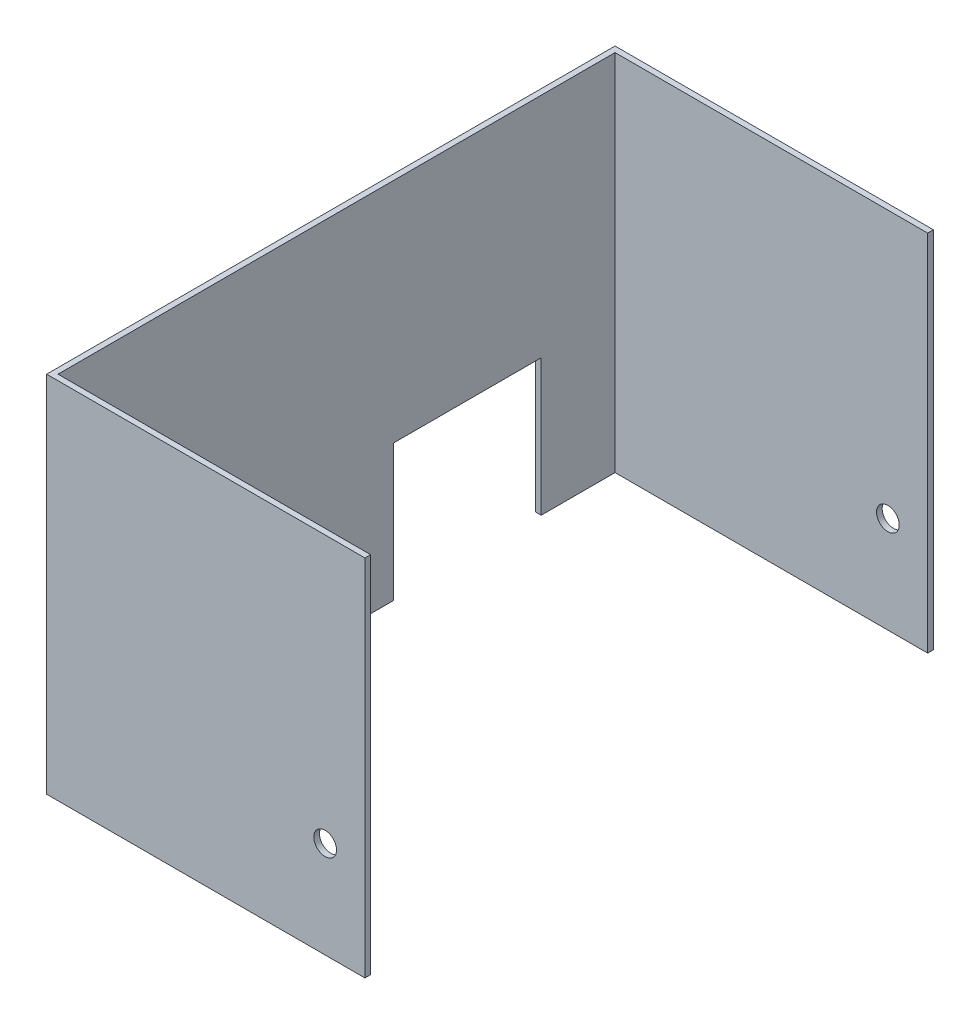
ISO-10303-21;
HEADER;
FILE_DESCRIPTION(('STEP AP214'),'2;1');
FILE_NAME('part.step','',(''),(''),'','','');
FILE_SCHEMA(('AUTOMOTIVE_DESIGN { 1 0 10303 214 1 1 1 1 }'));
ENDSEC;
DATA;
#1=APPLICATION_CONTEXT('core data for automotive mechanical design processes');
#2=APPLICATION_PROTOCOL_DEFINITION('international standard','automotive_design',2000,#1);
#3=PRODUCT_CONTEXT('',#1,'mechanical');
#4=PRODUCT('Part','Part','',(#3));
#5=PRODUCT_RELATED_PRODUCT_CATEGORY('part','',(#4));
#6=PRODUCT_DEFINITION_FORMATION('','',#4);
#7=PRODUCT_DEFINITION_CONTEXT('part definition',#1,'design');
#8=PRODUCT_DEFINITION('design','',#6,#7);
#9=PRODUCT_DEFINITION_SHAPE('','',#8);
#10=(LENGTH_UNIT() NAMED_UNIT(*) SI_UNIT(.MILLI.,.METRE.));
#11=(NAMED_UNIT(*) PLANE_ANGLE_UNIT() SI_UNIT($,.RADIAN.));
#12=(NAMED_UNIT(*) SI_UNIT($,.STERADIAN.) SOLID_ANGLE_UNIT());
#13=UNCERTAINTY_MEASURE_WITH_UNIT(LENGTH_MEASURE(1.E-05),#10,'distance_accuracy_value','');
#14=(GEOMETRIC_REPRESENTATION_CONTEXT(3) GLOBAL_UNCERTAINTY_ASSIGNED_CONTEXT((#13)) GLOBAL_UNIT_ASSIGNED_CONTEXT((#10,
#11,#12)) REPRESENTATION_CONTEXT('',''));
#15=CARTESIAN_POINT('',(0.,0.,0.));
#16=DIRECTION('',(0.,0.,1.));
#17=DIRECTION('',(1.,0.,0.));
#18=AXIS2_PLACEMENT_3D('',#15,#16,#17);
#19=CARTESIAN_POINT('',(0.,0.,0.));
#20=DIRECTION('',(0.,-1.,0.));
#21=DIRECTION('',(0.,0.,-1.));
#22=AXIS2_PLACEMENT_3D('',#19,#20,#21);
#23=PLANE('',#22);
#24=DIRECTION('',(1.,0.,0.));
#25=VECTOR('',#24,1.);
#26=CARTESIAN_POINT('',(0.,0.,-546.1));
#27=LINE('',#26,#25);
#28=CARTESIAN_POINT('',(0.,0.,-546.1));
#29=VERTEX_POINT('',#28);
#30=CARTESIAN_POINT('',(6.35,0.,-546.1));
#31=VERTEX_POINT('',#30);
#32=EDGE_CURVE('E174',#29,#31,#27,.T.);
#33=ORIENTED_EDGE('',*,*,#32,.F.);
#34=DIRECTION('',(0.,0.,1.));
#35=VECTOR('',#34,1.);
#36=CARTESIAN_POINT('',(0.,0.,0.));
#37=LINE('',#36,#35);
#38=CARTESIAN_POINT('',(0.,0.,-635.));
#39=VERTEX_POINT('',#38);
#40=EDGE_CURVE('E157',#39,#29,#37,.T.);
#41=ORIENTED_EDGE('',*,*,#40,.F.);
#42=DIRECTION('',(-1.,0.,0.));
#43=VECTOR('',#42,1.);
#44=CARTESIAN_POINT('',(0.,0.,-635.));
#45=LINE('',#44,#43);
#46=CARTESIAN_POINT('',(355.6,0.,-635.));
#47=VERTEX_POINT('',#46);
#48=EDGE_CURVE('E223',#47,#39,#45,.T.);
#49=ORIENTED_EDGE('',*,*,#48,.F.);
#50=DIRECTION('',(0.,0.,-1.));
#51=VECTOR('',#50,1.);
#52=CARTESIAN_POINT('',(355.6,0.,0.));
#53=LINE('',#52,#51);
#54=CARTESIAN_POINT('',(355.6,0.,-628.65));
#55=VERTEX_POINT('',#54);
#56=EDGE_CURVE('E240',#55,#47,#53,.T.);
#57=ORIENTED_EDGE('',*,*,#56,.F.);
#58=DIRECTION('',(-1.,0.,0.));
#59=VECTOR('',#58,1.);
#60=CARTESIAN_POINT('',(0.,0.,-628.65));
#61=LINE('',#60,#59);
#62=CARTESIAN_POINT('',(6.35,0.,-628.65));
#63=VERTEX_POINT('',#62);
#64=EDGE_CURVE('E199',#55,#63,#61,.T.);
#65=ORIENTED_EDGE('',*,*,#64,.T.);
#66=DIRECTION('',(0.,0.,1.));
#67=VECTOR('',#66,1.);
#68=CARTESIAN_POINT('',(6.35,0.,0.));
#69=LINE('',#68,#67);
#70=EDGE_CURVE('E194',#63,#31,#69,.T.);
#71=ORIENTED_EDGE('',*,*,#70,.T.);
#72=EDGE_LOOP('',(#33,#41,#49,#57,#65,#71));
#73=FACE_BOUND('',#72,.T.);
#74=ADVANCED_FACE('F44',(#73),#23,.T.);
#75=CARTESIAN_POINT('',(355.6,406.4,0.));
#76=DIRECTION('',(-1.,0.,0.));
#77=DIRECTION('',(0.,0.,1.));
#78=AXIS2_PLACEMENT_3D('',#75,#76,#77);
#79=PLANE('',#78);
#80=DIRECTION('',(0.,-1.,0.));
#81=VECTOR('',#80,1.);
#82=CARTESIAN_POINT('',(355.6,406.4,-6.35));
#83=LINE('',#82,#81);
#84=CARTESIAN_POINT('',(355.6,406.4,-6.35));
#85=VERTEX_POINT('',#84);
#86=CARTESIAN_POINT('',(355.6,0.,-6.35));
#87=VERTEX_POINT('',#86);
#88=EDGE_CURVE('E69',#85,#87,#83,.T.);
#89=ORIENTED_EDGE('',*,*,#88,.F.);
#90=DIRECTION('',(0.,0.,-1.));
#91=VECTOR('',#90,1.);
#92=CARTESIAN_POINT('',(355.6,406.4,0.));
#93=LINE('',#92,#91);
#94=CARTESIAN_POINT('',(355.6,406.4,0.));
#95=VERTEX_POINT('',#94);
#96=EDGE_CURVE('E227',#95,#85,#93,.T.);
#97=ORIENTED_EDGE('',*,*,#96,.F.);
#98=DIRECTION('',(0.,-1.,0.));
#99=VECTOR('',#98,1.);
#100=CARTESIAN_POINT('',(355.6,406.4,0.));
#101=LINE('',#100,#99);
#102=CARTESIAN_POINT('',(355.6,0.,0.));
#103=VERTEX_POINT('',#102);
#104=EDGE_CURVE('E54',#95,#103,#101,.T.);
#105=ORIENTED_EDGE('',*,*,#104,.T.);
#106=EDGE_CURVE('E241',#103,#87,#53,.T.);
#107=ORIENTED_EDGE('',*,*,#106,.T.);
#108=EDGE_LOOP('',(#89,#97,#105,#107));
#109=FACE_BOUND('',#108,.T.);
#110=ADVANCED_FACE('F259',(#109),#79,.F.);
#111=CARTESIAN_POINT('',(0.,406.4,0.));
#112=DIRECTION('',(0.,-1.,0.));
#113=DIRECTION('',(0.,0.,-1.));
#114=AXIS2_PLACEMENT_3D('',#111,#112,#113);
#115=PLANE('',#114);
#116=DIRECTION('',(1.,0.,0.));
#117=VECTOR('',#116,1.);
#118=CARTESIAN_POINT('',(0.,406.4,-6.35));
#119=LINE('',#118,#117);
#120=CARTESIAN_POINT('',(6.35,406.4,-6.35));
#121=VERTEX_POINT('',#120);
#122=EDGE_CURVE('E209',#121,#85,#119,.T.);
#123=ORIENTED_EDGE('',*,*,#122,.F.);
#124=DIRECTION('',(0.,0.,1.));
#125=VECTOR('',#124,1.);
#126=CARTESIAN_POINT('',(6.35,406.4,0.));
#127=LINE('',#126,#125);
#128=CARTESIAN_POINT('',(6.35,406.4,-628.65));
#129=VERTEX_POINT('',#128);
#130=EDGE_CURVE('E203',#129,#121,#127,.T.);
#131=ORIENTED_EDGE('',*,*,#130,.F.);
#132=DIRECTION('',(-1.,0.,0.));
#133=VECTOR('',#132,1.);
#134=CARTESIAN_POINT('',(0.,406.4,-628.65));
#135=LINE('',#134,#133);
#136=CARTESIAN_POINT('',(355.6,406.4,-628.65));
#137=VERTEX_POINT('',#136);
#138=EDGE_CURVE('E193',#137,#129,#135,.T.);
#139=ORIENTED_EDGE('',*,*,#138,.F.);
#140=CARTESIAN_POINT('',(355.6,406.4,-635.));
#141=VERTEX_POINT('',#140);
#142=EDGE_CURVE('E226',#137,#141,#93,.T.);
#143=ORIENTED_EDGE('',*,*,#142,.T.);
#144=DIRECTION('',(-1.,0.,0.));
#145=VECTOR('',#144,1.);
#146=CARTESIAN_POINT('',(0.,406.4,-635.));
#147=LINE('',#146,#145);
#148=CARTESIAN_POINT('',(0.,406.4,-635.));
#149=VERTEX_POINT('',#148);
#150=EDGE_CURVE('E231',#141,#149,#147,.T.);
#151=ORIENTED_EDGE('',*,*,#150,.T.);
#152=DIRECTION('',(0.,0.,1.));
#153=VECTOR('',#152,1.);
#154=CARTESIAN_POINT('',(0.,406.4,0.));
#155=LINE('',#154,#153);
#156=CARTESIAN_POINT('',(0.,406.4,0.));
#157=VERTEX_POINT('',#156);
#158=EDGE_CURVE('E218',#149,#157,#155,.T.);
#159=ORIENTED_EDGE('',*,*,#158,.T.);
#160=DIRECTION('',(1.,0.,0.));
#161=VECTOR('',#160,1.);
#162=CARTESIAN_POINT('',(0.,406.4,0.));
#163=LINE('',#162,#161);
#164=EDGE_CURVE('E222',#157,#95,#163,.T.);
#165=ORIENTED_EDGE('',*,*,#164,.T.);
#166=ORIENTED_EDGE('',*,*,#96,.T.);
#167=EDGE_LOOP('',(#123,#131,#139,#143,#151,#159,#165,#166));
#168=FACE_BOUND('',#167,.T.);
#169=ADVANCED_FACE('F277',(#168),#115,.F.);
#170=DIRECTION('',(1.,0.,0.));
#171=VECTOR('',#170,1.);
#172=CARTESIAN_POINT('',(0.,0.,-381.));
#173=LINE('',#172,#171);
#174=CARTESIAN_POINT('',(0.,0.,-381.));
#175=VERTEX_POINT('',#174);
#176=CARTESIAN_POINT('',(6.35,0.,-381.));
#177=VERTEX_POINT('',#176);
#178=EDGE_CURVE('E178',#175,#177,#173,.T.);
#179=ORIENTED_EDGE('',*,*,#178,.T.);
#180=CARTESIAN_POINT('',(6.35,0.,-6.35));
#181=VERTEX_POINT('',#180);
#182=EDGE_CURVE('E177',#177,#181,#69,.T.);
#183=ORIENTED_EDGE('',*,*,#182,.T.);
#184=DIRECTION('',(1.,0.,0.));
#185=VECTOR('',#184,1.);
#186=CARTESIAN_POINT('',(0.,0.,-6.35));
#187=LINE('',#186,#185);
#188=EDGE_CURVE('E198',#181,#87,#187,.T.);
#189=ORIENTED_EDGE('',*,*,#188,.T.);
#190=ORIENTED_EDGE('',*,*,#106,.F.);
#191=DIRECTION('',(1.,0.,0.));
#192=VECTOR('',#191,1.);
#193=CARTESIAN_POINT('',(0.,0.,0.));
#194=LINE('',#193,#192);
#195=CARTESIAN_POINT('',(0.,0.,0.));
#196=VERTEX_POINT('',#195);
#197=EDGE_CURVE('E237',#196,#103,#194,.T.);
#198=ORIENTED_EDGE('',*,*,#197,.F.);
#199=EDGE_CURVE('E188',#175,#196,#37,.T.);
#200=ORIENTED_EDGE('',*,*,#199,.F.);
#201=EDGE_LOOP('',(#179,#183,#189,#190,#198,#200));
#202=FACE_BOUND('',#201,.T.);
#203=ADVANCED_FACE('F263',(#202),#23,.T.);
#204=CARTESIAN_POINT('',(0.,406.4,0.));
#205=DIRECTION('',(1.,0.,0.));
#206=DIRECTION('',(0.,0.,-1.));
#207=AXIS2_PLACEMENT_3D('',#204,#205,#206);
#208=PLANE('',#207);
#209=ORIENTED_EDGE('',*,*,#40,.T.);
#210=DIRECTION('',(0.,1.,0.));
#211=VECTOR('',#210,1.);
#212=CARTESIAN_POINT('',(0.,0.,-546.1));
#213=LINE('',#212,#211);
#214=CARTESIAN_POINT('',(0.,152.4,-546.1));
#215=VERTEX_POINT('',#214);
#216=EDGE_CURVE('E137',#29,#215,#213,.T.);
#217=ORIENTED_EDGE('',*,*,#216,.T.);
#218=DIRECTION('',(0.,0.,1.));
#219=VECTOR('',#218,1.);
#220=CARTESIAN_POINT('',(0.,152.4,-546.1));
#221=LINE('',#220,#219);
#222=CARTESIAN_POINT('',(0.,152.4,-381.));
#223=VERTEX_POINT('',#222);
#224=EDGE_CURVE('E147',#215,#223,#221,.T.);
#225=ORIENTED_EDGE('',*,*,#224,.T.);
#226=DIRECTION('',(0.,-1.,0.));
#227=VECTOR('',#226,1.);
#228=CARTESIAN_POINT('',(0.,0.,-381.));
#229=LINE('',#228,#227);
#230=EDGE_CURVE('E144',#223,#175,#229,.T.);
#231=ORIENTED_EDGE('',*,*,#230,.T.);
#232=ORIENTED_EDGE('',*,*,#199,.T.);
#233=DIRECTION('',(0.,-1.,0.));
#234=VECTOR('',#233,1.);
#235=CARTESIAN_POINT('',(0.,406.4,0.));
#236=LINE('',#235,#234);
#237=EDGE_CURVE('E11',#157,#196,#236,.T.);
#238=ORIENTED_EDGE('',*,*,#237,.F.);
#239=ORIENTED_EDGE('',*,*,#158,.F.);
#240=DIRECTION('',(0.,-1.,0.));
#241=VECTOR('',#240,1.);
#242=CARTESIAN_POINT('',(0.,406.4,-635.));
#243=LINE('',#242,#241);
#244=EDGE_CURVE('E234',#149,#39,#243,.T.);
#245=ORIENTED_EDGE('',*,*,#244,.T.);
#246=EDGE_LOOP('',(#209,#217,#225,#231,#232,#238,#239,#245));
#247=FACE_BOUND('',#246,.T.);
#248=ADVANCED_FACE('F46',(#247),#208,.F.);
#249=CARTESIAN_POINT('',(0.,406.4,0.));
#250=DIRECTION('',(0.,0.,-1.));
#251=DIRECTION('',(-1.,0.,0.));
#252=AXIS2_PLACEMENT_3D('',#249,#250,#251);
#253=PLANE('',#252);
#254=CARTESIAN_POINT('',(311.15,107.95,0.));
#255=DIRECTION('',(0.,0.,1.));
#256=DIRECTION('',(1.,0.,0.));
#257=AXIS2_PLACEMENT_3D('',#254,#255,#256);
#258=CIRCLE('',#257,12.7);
#259=CARTESIAN_POINT('',(323.85,107.95,0.));
#260=VERTEX_POINT('',#259);
#261=EDGE_CURVE('E346',#260,#260,#258,.T.);
#262=ORIENTED_EDGE('',*,*,#261,.F.);
#263=EDGE_LOOP('',(#262));
#264=FACE_BOUND('',#263,.T.);
#265=ORIENTED_EDGE('',*,*,#197,.T.);
#266=ORIENTED_EDGE('',*,*,#104,.F.);
#267=ORIENTED_EDGE('',*,*,#164,.F.);
#268=ORIENTED_EDGE('',*,*,#237,.T.);
#269=EDGE_LOOP('',(#265,#266,#267,#268));
#270=FACE_BOUND('',#269,.T.);
#271=ADVANCED_FACE('F281',(#264,#270),#253,.F.);
#272=ORIENTED_EDGE('',*,*,#142,.F.);
#273=DIRECTION('',(0.,-1.,0.));
#274=VECTOR('',#273,1.);
#275=CARTESIAN_POINT('',(355.6,406.4,-628.65));
#276=LINE('',#275,#274);
#277=EDGE_CURVE('E192',#137,#55,#276,.T.);
#278=ORIENTED_EDGE('',*,*,#277,.T.);
#279=ORIENTED_EDGE('',*,*,#56,.T.);
#280=DIRECTION('',(0.,-1.,0.));
#281=VECTOR('',#280,1.);
#282=CARTESIAN_POINT('',(355.6,406.4,-635.));
#283=LINE('',#282,#281);
#284=EDGE_CURVE('E249',#141,#47,#283,.T.);
#285=ORIENTED_EDGE('',*,*,#284,.F.);
#286=EDGE_LOOP('',(#272,#278,#279,#285));
#287=FACE_BOUND('',#286,.T.);
#288=ADVANCED_FACE('F290',(#287),#79,.F.);
#289=CARTESIAN_POINT('',(0.,406.4,-635.));
#290=DIRECTION('',(0.,0.,1.));
#291=DIRECTION('',(1.,0.,0.));
#292=AXIS2_PLACEMENT_3D('',#289,#290,#291);
#293=PLANE('',#292);
#294=CARTESIAN_POINT('',(311.15,107.95,-635.));
#295=DIRECTION('',(0.,0.,1.));
#296=DIRECTION('',(1.,0.,0.));
#297=AXIS2_PLACEMENT_3D('',#294,#295,#296);
#298=CIRCLE('',#297,12.7);
#299=CARTESIAN_POINT('',(323.85,107.95,-635.));
#300=VERTEX_POINT('',#299);
#301=EDGE_CURVE('E349',#300,#300,#298,.T.);
#302=ORIENTED_EDGE('',*,*,#301,.T.);
#303=EDGE_LOOP('',(#302));
#304=FACE_BOUND('',#303,.T.);
#305=ORIENTED_EDGE('',*,*,#48,.T.);
#306=ORIENTED_EDGE('',*,*,#244,.F.);
#307=ORIENTED_EDGE('',*,*,#150,.F.);
#308=ORIENTED_EDGE('',*,*,#284,.T.);
#309=EDGE_LOOP('',(#305,#306,#307,#308));
#310=FACE_BOUND('',#309,.T.);
#311=ADVANCED_FACE('F294',(#304,#310),#293,.F.);
#312=CARTESIAN_POINT('',(6.35,406.4,0.));
#313=DIRECTION('',(1.,0.,0.));
#314=DIRECTION('',(0.,0.,-1.));
#315=AXIS2_PLACEMENT_3D('',#312,#313,#314);
#316=PLANE('',#315);
#317=DIRECTION('',(0.,1.,0.));
#318=VECTOR('',#317,1.);
#319=CARTESIAN_POINT('',(6.35,0.,-546.1));
#320=LINE('',#319,#318);
#321=CARTESIAN_POINT('',(6.35,152.4,-546.1));
#322=VERTEX_POINT('',#321);
#323=EDGE_CURVE('E61',#31,#322,#320,.T.);
#324=ORIENTED_EDGE('',*,*,#323,.F.);
#325=ORIENTED_EDGE('',*,*,#70,.F.);
#326=DIRECTION('',(0.,-1.,0.));
#327=VECTOR('',#326,1.);
#328=CARTESIAN_POINT('',(6.35,406.4,-628.65));
#329=LINE('',#328,#327);
#330=EDGE_CURVE('E189',#129,#63,#329,.T.);
#331=ORIENTED_EDGE('',*,*,#330,.F.);
#332=ORIENTED_EDGE('',*,*,#130,.T.);
#333=DIRECTION('',(0.,-1.,0.));
#334=VECTOR('',#333,1.);
#335=CARTESIAN_POINT('',(6.35,406.4,-6.35));
#336=LINE('',#335,#334);
#337=EDGE_CURVE('E184',#121,#181,#336,.T.);
#338=ORIENTED_EDGE('',*,*,#337,.T.);
#339=ORIENTED_EDGE('',*,*,#182,.F.);
#340=DIRECTION('',(0.,-1.,0.));
#341=VECTOR('',#340,1.);
#342=CARTESIAN_POINT('',(6.35,0.,-381.));
#343=LINE('',#342,#341);
#344=CARTESIAN_POINT('',(6.35,152.4,-381.));
#345=VERTEX_POINT('',#344);
#346=EDGE_CURVE('E159',#345,#177,#343,.T.);
#347=ORIENTED_EDGE('',*,*,#346,.F.);
#348=DIRECTION('',(0.,0.,1.));
#349=VECTOR('',#348,1.);
#350=CARTESIAN_POINT('',(6.35,152.4,-546.1));
#351=LINE('',#350,#349);
#352=EDGE_CURVE('E162',#322,#345,#351,.T.);
#353=ORIENTED_EDGE('',*,*,#352,.F.);
#354=EDGE_LOOP('',(#324,#325,#331,#332,#338,#339,#347,#353));
#355=FACE_BOUND('',#354,.T.);
#356=ADVANCED_FACE('F270',(#355),#316,.T.);
#357=CARTESIAN_POINT('',(0.,406.4,-6.35));
#358=DIRECTION('',(0.,0.,-1.));
#359=DIRECTION('',(-1.,0.,0.));
#360=AXIS2_PLACEMENT_3D('',#357,#358,#359);
#361=PLANE('',#360);
#362=CARTESIAN_POINT('',(311.15,107.95,-6.34999999999997));
#363=DIRECTION('',(0.,0.,-1.));
#364=DIRECTION('',(-1.,0.,0.));
#365=AXIS2_PLACEMENT_3D('',#362,#363,#364);
#366=CIRCLE('',#365,12.7);
#367=CARTESIAN_POINT('',(298.45,107.95,-6.34999999999997));
#368=VERTEX_POINT('',#367);
#369=EDGE_CURVE('E165',#368,#368,#366,.T.);
#370=ORIENTED_EDGE('',*,*,#369,.F.);
#371=EDGE_LOOP('',(#370));
#372=FACE_BOUND('',#371,.T.);
#373=ORIENTED_EDGE('',*,*,#188,.F.);
#374=ORIENTED_EDGE('',*,*,#337,.F.);
#375=ORIENTED_EDGE('',*,*,#122,.T.);
#376=ORIENTED_EDGE('',*,*,#88,.T.);
#377=EDGE_LOOP('',(#373,#374,#375,#376));
#378=FACE_BOUND('',#377,.T.);
#379=ADVANCED_FACE('F267',(#372,#378),#361,.T.);
#380=CARTESIAN_POINT('',(0.,406.4,-628.65));
#381=DIRECTION('',(0.,0.,1.));
#382=DIRECTION('',(1.,0.,0.));
#383=AXIS2_PLACEMENT_3D('',#380,#381,#382);
#384=PLANE('',#383);
#385=CARTESIAN_POINT('',(311.15,107.95,-628.65));
#386=DIRECTION('',(0.,0.,1.));
#387=DIRECTION('',(1.,0.,0.));
#388=AXIS2_PLACEMENT_3D('',#385,#386,#387);
#389=CIRCLE('',#388,12.7);
#390=CARTESIAN_POINT('',(323.85,107.95,-628.65));
#391=VERTEX_POINT('',#390);
#392=EDGE_CURVE('E48',#391,#391,#389,.T.);
#393=ORIENTED_EDGE('',*,*,#392,.F.);
#394=EDGE_LOOP('',(#393));
#395=FACE_BOUND('',#394,.T.);
#396=ORIENTED_EDGE('',*,*,#64,.F.);
#397=ORIENTED_EDGE('',*,*,#277,.F.);
#398=ORIENTED_EDGE('',*,*,#138,.T.);
#399=ORIENTED_EDGE('',*,*,#330,.T.);
#400=EDGE_LOOP('',(#396,#397,#398,#399));
#401=FACE_BOUND('',#400,.T.);
#402=ADVANCED_FACE('F306',(#395,#401),#384,.T.);
#403=CARTESIAN_POINT('',(0.,0.,-546.1));
#404=DIRECTION('',(0.,0.,-1.));
#405=DIRECTION('',(-1.,0.,0.));
#406=AXIS2_PLACEMENT_3D('',#403,#404,#405);
#407=PLANE('',#406);
#408=ORIENTED_EDGE('',*,*,#323,.T.);
#409=DIRECTION('',(1.,0.,0.));
#410=VECTOR('',#409,1.);
#411=CARTESIAN_POINT('',(0.,152.4,-546.1));
#412=LINE('',#411,#410);
#413=EDGE_CURVE('E133',#215,#322,#412,.T.);
#414=ORIENTED_EDGE('',*,*,#413,.F.);
#415=ORIENTED_EDGE('',*,*,#216,.F.);
#416=ORIENTED_EDGE('',*,*,#32,.T.);
#417=EDGE_LOOP('',(#408,#414,#415,#416));
#418=FACE_BOUND('',#417,.T.);
#419=ADVANCED_FACE('F135',(#418),#407,.F.);
#420=CARTESIAN_POINT('',(0.,0.,-381.));
#421=DIRECTION('',(0.,0.,1.));
#422=DIRECTION('',(1.,0.,0.));
#423=AXIS2_PLACEMENT_3D('',#420,#421,#422);
#424=PLANE('',#423);
#425=ORIENTED_EDGE('',*,*,#346,.T.);
#426=ORIENTED_EDGE('',*,*,#178,.F.);
#427=ORIENTED_EDGE('',*,*,#230,.F.);
#428=DIRECTION('',(1.,0.,0.));
#429=VECTOR('',#428,1.);
#430=CARTESIAN_POINT('',(0.,152.4,-381.));
#431=LINE('',#430,#429);
#432=EDGE_CURVE('E143',#223,#345,#431,.T.);
#433=ORIENTED_EDGE('',*,*,#432,.T.);
#434=EDGE_LOOP('',(#425,#426,#427,#433));
#435=FACE_BOUND('',#434,.T.);
#436=ADVANCED_FACE('F297',(#435),#424,.F.);
#437=CARTESIAN_POINT('',(0.,152.4,-546.1));
#438=DIRECTION('',(0.,1.,0.));
#439=DIRECTION('',(0.,0.,1.));
#440=AXIS2_PLACEMENT_3D('',#437,#438,#439);
#441=PLANE('',#440);
#442=ORIENTED_EDGE('',*,*,#352,.T.);
#443=ORIENTED_EDGE('',*,*,#432,.F.);
#444=ORIENTED_EDGE('',*,*,#224,.F.);
#445=ORIENTED_EDGE('',*,*,#413,.T.);
#446=EDGE_LOOP('',(#442,#443,#444,#445));
#447=FACE_BOUND('',#446,.T.);
#448=ADVANCED_FACE('F148',(#447),#441,.F.);
#449=CARTESIAN_POINT('',(311.15,107.95,-635.));
#450=DIRECTION('',(0.,0.,1.));
#451=DIRECTION('',(1.,0.,0.));
#452=AXIS2_PLACEMENT_3D('',#449,#450,#451);
#453=CYLINDRICAL_SURFACE('',#452,12.7);
#454=ORIENTED_EDGE('',*,*,#392,.T.);
#455=EDGE_LOOP('',(#454));
#456=FACE_BOUND('',#455,.T.);
#457=ORIENTED_EDGE('',*,*,#301,.F.);
#458=EDGE_LOOP('',(#457));
#459=FACE_BOUND('',#458,.T.);
#460=ADVANCED_FACE('F304',(#456,#459),#453,.F.);
#461=ORIENTED_EDGE('',*,*,#369,.T.);
#462=EDGE_LOOP('',(#461));
#463=FACE_BOUND('',#462,.T.);
#464=ORIENTED_EDGE('',*,*,#261,.T.);
#465=EDGE_LOOP('',(#464));
#466=FACE_BOUND('',#465,.T.);
#467=ADVANCED_FACE('F361',(#463,#466),#453,.F.);
#468=CLOSED_SHELL('',(#74,#110,#169,#203,#248,#271,#288,#311,#356,#379,#402,#419,#436,#448,#460,#467));
#469=MANIFOLD_SOLID_BREP('B2',#468);
#470=ADVANCED_BREP_SHAPE_REPRESENTATION('',(#18,#469),#14);
#471=SHAPE_DEFINITION_REPRESENTATION(#9,#470);
ENDSEC;
END-ISO-10303-21;
